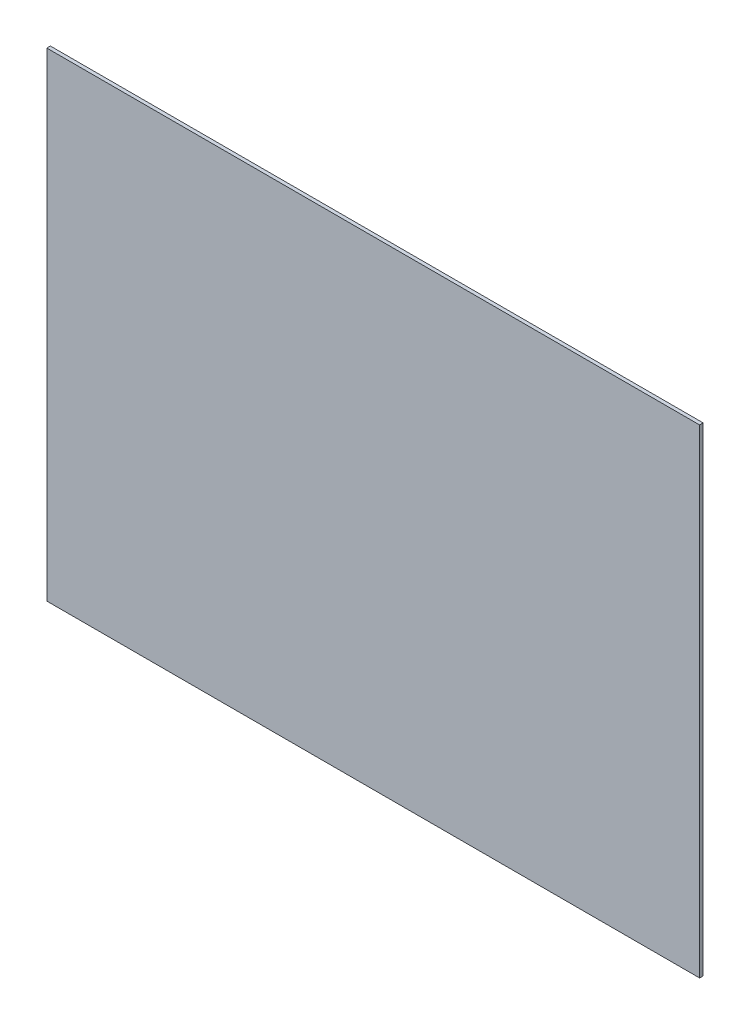
ISO-10303-21;
HEADER;
FILE_DESCRIPTION(('STEP AP214'),'2;1');
FILE_NAME('part.step','',(''),(''),'','','');
FILE_SCHEMA(('AUTOMOTIVE_DESIGN { 1 0 10303 214 1 1 1 1 }'));
ENDSEC;
DATA;
#1=APPLICATION_CONTEXT('core data for automotive mechanical design processes');
#2=APPLICATION_PROTOCOL_DEFINITION('international standard','automotive_design',2000,#1);
#3=PRODUCT_CONTEXT('',#1,'mechanical');
#4=PRODUCT('Part','Part','',(#3));
#5=PRODUCT_RELATED_PRODUCT_CATEGORY('part','',(#4));
#6=PRODUCT_DEFINITION_FORMATION('','',#4);
#7=PRODUCT_DEFINITION_CONTEXT('part definition',#1,'design');
#8=PRODUCT_DEFINITION('design','',#6,#7);
#9=PRODUCT_DEFINITION_SHAPE('','',#8);
#10=(LENGTH_UNIT() NAMED_UNIT(*) SI_UNIT(.MILLI.,.METRE.));
#11=(NAMED_UNIT(*) PLANE_ANGLE_UNIT() SI_UNIT($,.RADIAN.));
#12=(NAMED_UNIT(*) SI_UNIT($,.STERADIAN.) SOLID_ANGLE_UNIT());
#13=UNCERTAINTY_MEASURE_WITH_UNIT(LENGTH_MEASURE(1.E-05),#10,'distance_accuracy_value','');
#14=(GEOMETRIC_REPRESENTATION_CONTEXT(3) GLOBAL_UNCERTAINTY_ASSIGNED_CONTEXT((#13)) GLOBAL_UNIT_ASSIGNED_CONTEXT((#10,
#11,#12)) REPRESENTATION_CONTEXT('',''));
#15=CARTESIAN_POINT('',(0.,0.,0.));
#16=DIRECTION('',(0.,0.,1.));
#17=DIRECTION('',(1.,0.,0.));
#18=AXIS2_PLACEMENT_3D('',#15,#16,#17);
#19=CARTESIAN_POINT('',(0.,0.,3.175));
#20=DIRECTION('',(1.,0.,0.));
#21=DIRECTION('',(0.,0.,-1.));
#22=AXIS2_PLACEMENT_3D('',#19,#20,#21);
#23=PLANE('',#22);
#24=DIRECTION('',(0.,-1.,0.));
#25=VECTOR('',#24,1.);
#26=CARTESIAN_POINT('',(0.,0.,0.));
#27=LINE('',#26,#25);
#28=CARTESIAN_POINT('',(0.,428.625,0.));
#29=VERTEX_POINT('',#28);
#30=CARTESIAN_POINT('',(0.,0.,0.));
#31=VERTEX_POINT('',#30);
#32=EDGE_CURVE('E96',#29,#31,#27,.T.);
#33=ORIENTED_EDGE('',*,*,#32,.T.);
#34=DIRECTION('',(0.,0.,-1.));
#35=VECTOR('',#34,1.);
#36=CARTESIAN_POINT('',(0.,0.,3.175));
#37=LINE('',#36,#35);
#38=CARTESIAN_POINT('',(0.,0.,3.175));
#39=VERTEX_POINT('',#38);
#40=EDGE_CURVE('E11',#39,#31,#37,.T.);
#41=ORIENTED_EDGE('',*,*,#40,.F.);
#42=DIRECTION('',(0.,-1.,0.));
#43=VECTOR('',#42,1.);
#44=CARTESIAN_POINT('',(0.,0.,3.175));
#45=LINE('',#44,#43);
#46=CARTESIAN_POINT('',(0.,428.625,3.175));
#47=VERTEX_POINT('',#46);
#48=EDGE_CURVE('E84',#47,#39,#45,.T.);
#49=ORIENTED_EDGE('',*,*,#48,.F.);
#50=DIRECTION('',(0.,0.,-1.));
#51=VECTOR('',#50,1.);
#52=CARTESIAN_POINT('',(0.,428.625,3.175));
#53=LINE('',#52,#51);
#54=EDGE_CURVE('E92',#47,#29,#53,.T.);
#55=ORIENTED_EDGE('',*,*,#54,.T.);
#56=EDGE_LOOP('',(#33,#41,#49,#55));
#57=FACE_BOUND('',#56,.T.);
#58=ADVANCED_FACE('F33',(#57),#23,.F.);
#59=CARTESIAN_POINT('',(0.,0.,3.175));
#60=DIRECTION('',(0.,1.,0.));
#61=DIRECTION('',(0.,0.,1.));
#62=AXIS2_PLACEMENT_3D('',#59,#60,#61);
#63=PLANE('',#62);
#64=DIRECTION('',(1.,0.,0.));
#65=VECTOR('',#64,1.);
#66=CARTESIAN_POINT('',(0.,0.,0.));
#67=LINE('',#66,#65);
#68=CARTESIAN_POINT('',(584.2,0.,0.));
#69=VERTEX_POINT('',#68);
#70=EDGE_CURVE('E88',#31,#69,#67,.T.);
#71=ORIENTED_EDGE('',*,*,#70,.T.);
#72=DIRECTION('',(0.,0.,-1.));
#73=VECTOR('',#72,1.);
#74=CARTESIAN_POINT('',(584.2,0.,3.175));
#75=LINE('',#74,#73);
#76=CARTESIAN_POINT('',(584.2,0.,3.175));
#77=VERTEX_POINT('',#76);
#78=EDGE_CURVE('E41',#77,#69,#75,.T.);
#79=ORIENTED_EDGE('',*,*,#78,.F.);
#80=DIRECTION('',(1.,0.,0.));
#81=VECTOR('',#80,1.);
#82=CARTESIAN_POINT('',(0.,0.,3.175));
#83=LINE('',#82,#81);
#84=EDGE_CURVE('E79',#39,#77,#83,.T.);
#85=ORIENTED_EDGE('',*,*,#84,.F.);
#86=ORIENTED_EDGE('',*,*,#40,.T.);
#87=EDGE_LOOP('',(#71,#79,#85,#86));
#88=FACE_BOUND('',#87,.T.);
#89=ADVANCED_FACE('F87',(#88),#63,.F.);
#90=CARTESIAN_POINT('',(584.2,0.,3.175));
#91=DIRECTION('',(-1.,0.,0.));
#92=DIRECTION('',(0.,0.,1.));
#93=AXIS2_PLACEMENT_3D('',#90,#91,#92);
#94=PLANE('',#93);
#95=DIRECTION('',(0.,1.,0.));
#96=VECTOR('',#95,1.);
#97=CARTESIAN_POINT('',(584.2,0.,0.));
#98=LINE('',#97,#96);
#99=CARTESIAN_POINT('',(584.2,428.625,0.));
#100=VERTEX_POINT('',#99);
#101=EDGE_CURVE('E66',#69,#100,#98,.T.);
#102=ORIENTED_EDGE('',*,*,#101,.T.);
#103=DIRECTION('',(0.,0.,-1.));
#104=VECTOR('',#103,1.);
#105=CARTESIAN_POINT('',(584.2,428.625,3.175));
#106=LINE('',#105,#104);
#107=CARTESIAN_POINT('',(584.2,428.625,3.175));
#108=VERTEX_POINT('',#107);
#109=EDGE_CURVE('E89',#108,#100,#106,.T.);
#110=ORIENTED_EDGE('',*,*,#109,.F.);
#111=DIRECTION('',(0.,1.,0.));
#112=VECTOR('',#111,1.);
#113=CARTESIAN_POINT('',(584.2,0.,3.175));
#114=LINE('',#113,#112);
#115=EDGE_CURVE('E82',#77,#108,#114,.T.);
#116=ORIENTED_EDGE('',*,*,#115,.F.);
#117=ORIENTED_EDGE('',*,*,#78,.T.);
#118=EDGE_LOOP('',(#102,#110,#116,#117));
#119=FACE_BOUND('',#118,.T.);
#120=ADVANCED_FACE('F90',(#119),#94,.F.);
#121=CARTESIAN_POINT('',(0.,428.625,3.175));
#122=DIRECTION('',(0.,-1.,0.));
#123=DIRECTION('',(0.,0.,-1.));
#124=AXIS2_PLACEMENT_3D('',#121,#122,#123);
#125=PLANE('',#124);
#126=DIRECTION('',(-1.,0.,0.));
#127=VECTOR('',#126,1.);
#128=CARTESIAN_POINT('',(0.,428.625,0.));
#129=LINE('',#128,#127);
#130=EDGE_CURVE('E72',#100,#29,#129,.T.);
#131=ORIENTED_EDGE('',*,*,#130,.T.);
#132=ORIENTED_EDGE('',*,*,#54,.F.);
#133=DIRECTION('',(-1.,0.,0.));
#134=VECTOR('',#133,1.);
#135=CARTESIAN_POINT('',(0.,428.625,3.175));
#136=LINE('',#135,#134);
#137=EDGE_CURVE('E49',#108,#47,#136,.T.);
#138=ORIENTED_EDGE('',*,*,#137,.F.);
#139=ORIENTED_EDGE('',*,*,#109,.T.);
#140=EDGE_LOOP('',(#131,#132,#138,#139));
#141=FACE_BOUND('',#140,.T.);
#142=ADVANCED_FACE('F103',(#141),#125,.F.);
#143=CARTESIAN_POINT('',(0.,0.,3.175));
#144=DIRECTION('',(0.,0.,-1.));
#145=DIRECTION('',(-1.,0.,0.));
#146=AXIS2_PLACEMENT_3D('',#143,#144,#145);
#147=PLANE('',#146);
#148=ORIENTED_EDGE('',*,*,#48,.T.);
#149=ORIENTED_EDGE('',*,*,#84,.T.);
#150=ORIENTED_EDGE('',*,*,#115,.T.);
#151=ORIENTED_EDGE('',*,*,#137,.T.);
#152=EDGE_LOOP('',(#148,#149,#150,#151));
#153=FACE_BOUND('',#152,.T.);
#154=ADVANCED_FACE('F80',(#153),#147,.F.);
#155=CARTESIAN_POINT('',(0.,0.,0.));
#156=DIRECTION('',(0.,0.,-1.));
#157=DIRECTION('',(-1.,0.,0.));
#158=AXIS2_PLACEMENT_3D('',#155,#156,#157);
#159=PLANE('',#158);
#160=ORIENTED_EDGE('',*,*,#32,.F.);
#161=ORIENTED_EDGE('',*,*,#130,.F.);
#162=ORIENTED_EDGE('',*,*,#101,.F.);
#163=ORIENTED_EDGE('',*,*,#70,.F.);
#164=EDGE_LOOP('',(#160,#161,#162,#163));
#165=FACE_BOUND('',#164,.T.);
#166=ADVANCED_FACE('F106',(#165),#159,.T.);
#167=CLOSED_SHELL('',(#58,#89,#120,#142,#154,#166));
#168=MANIFOLD_SOLID_BREP('B2',#167);
#169=ADVANCED_BREP_SHAPE_REPRESENTATION('',(#18,#168),#14);
#170=SHAPE_DEFINITION_REPRESENTATION(#9,#169);
ENDSEC;
END-ISO-10303-21;
